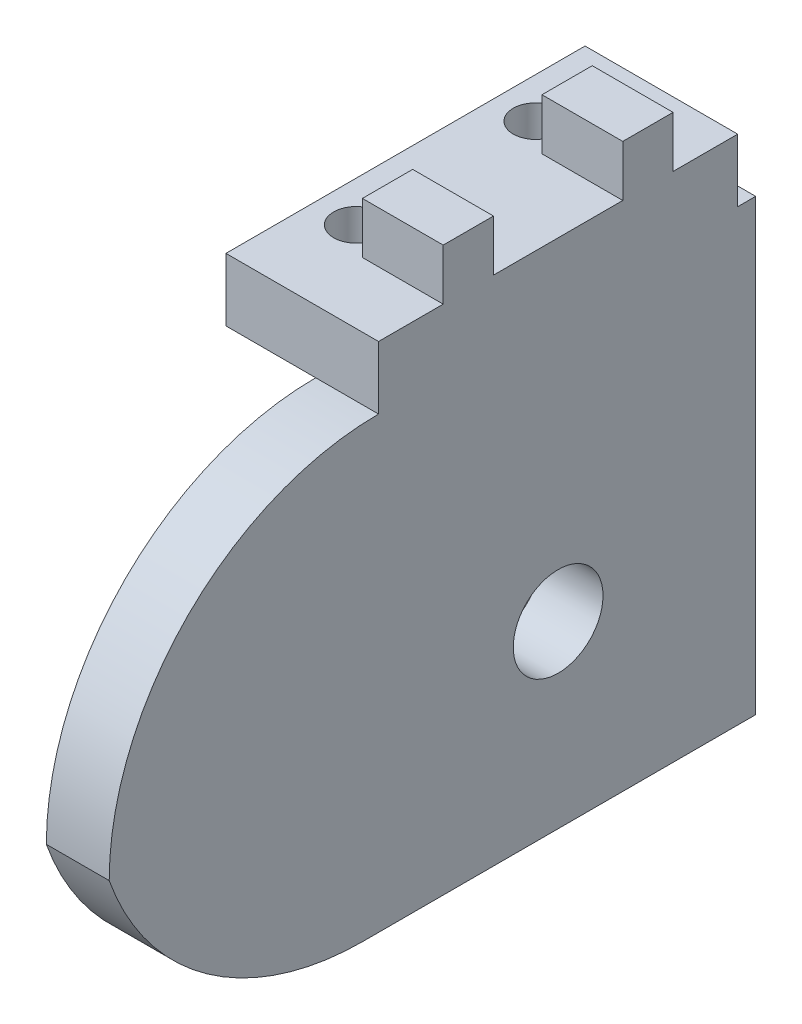
ISO-10303-21;
HEADER;
FILE_DESCRIPTION(('STEP AP214'),'2;1');
FILE_NAME('part.step','',(''),(''),'','','');
FILE_SCHEMA(('AUTOMOTIVE_DESIGN { 1 0 10303 214 1 1 1 1 }'));
ENDSEC;
DATA;
#1=APPLICATION_CONTEXT('core data for automotive mechanical design processes');
#2=APPLICATION_PROTOCOL_DEFINITION('international standard','automotive_design',2000,#1);
#3=PRODUCT_CONTEXT('',#1,'mechanical');
#4=PRODUCT('Part','Part','',(#3));
#5=PRODUCT_RELATED_PRODUCT_CATEGORY('part','',(#4));
#6=PRODUCT_DEFINITION_FORMATION('','',#4);
#7=PRODUCT_DEFINITION_CONTEXT('part definition',#1,'design');
#8=PRODUCT_DEFINITION('design','',#6,#7);
#9=PRODUCT_DEFINITION_SHAPE('','',#8);
#10=(LENGTH_UNIT() NAMED_UNIT(*) SI_UNIT(.MILLI.,.METRE.));
#11=(NAMED_UNIT(*) PLANE_ANGLE_UNIT() SI_UNIT($,.RADIAN.));
#12=(NAMED_UNIT(*) SI_UNIT($,.STERADIAN.) SOLID_ANGLE_UNIT());
#13=UNCERTAINTY_MEASURE_WITH_UNIT(LENGTH_MEASURE(1.E-05),#10,'distance_accuracy_value','');
#14=(GEOMETRIC_REPRESENTATION_CONTEXT(3) GLOBAL_UNCERTAINTY_ASSIGNED_CONTEXT((#13)) GLOBAL_UNIT_ASSIGNED_CONTEXT((#10,
#11,#12)) REPRESENTATION_CONTEXT('',''));
#15=CARTESIAN_POINT('',(0.,0.,0.));
#16=DIRECTION('',(0.,0.,1.));
#17=DIRECTION('',(1.,0.,0.));
#18=AXIS2_PLACEMENT_3D('',#15,#16,#17);
#19=CARTESIAN_POINT('',(0.,0.,0.));
#20=DIRECTION('',(0.,-1.,0.));
#21=DIRECTION('',(0.,0.,-1.));
#22=AXIS2_PLACEMENT_3D('',#19,#20,#21);
#23=PLANE('',#22);
#24=DIRECTION('',(0.,0.,-1.));
#25=VECTOR('',#24,1.);
#26=CARTESIAN_POINT('',(-10.,0.,50.));
#27=LINE('',#26,#25);
#28=CARTESIAN_POINT('',(-10.,0.,20.));
#29=VERTEX_POINT('',#28);
#30=CARTESIAN_POINT('',(-10.,0.,-20.));
#31=VERTEX_POINT('',#30);
#32=EDGE_CURVE('E190',#29,#31,#27,.T.);
#33=ORIENTED_EDGE('',*,*,#32,.F.);
#34=DIRECTION('',(1.,0.,0.));
#35=VECTOR('',#34,1.);
#36=CARTESIAN_POINT('',(20.,0.,20.));
#37=LINE('',#36,#35);
#38=CARTESIAN_POINT('',(-20.,0.,20.));
#39=VERTEX_POINT('',#38);
#40=EDGE_CURVE('E166',#39,#29,#37,.T.);
#41=ORIENTED_EDGE('',*,*,#40,.F.);
#42=DIRECTION('',(0.,0.,1.));
#43=VECTOR('',#42,1.);
#44=CARTESIAN_POINT('',(-20.,0.,-20.));
#45=LINE('',#44,#43);
#46=CARTESIAN_POINT('',(-20.,0.,-20.));
#47=VERTEX_POINT('',#46);
#48=EDGE_CURVE('E169',#47,#39,#45,.T.);
#49=ORIENTED_EDGE('',*,*,#48,.F.);
#50=DIRECTION('',(-1.,0.,0.));
#51=VECTOR('',#50,1.);
#52=CARTESIAN_POINT('',(20.,0.,-20.));
#53=LINE('',#52,#51);
#54=EDGE_CURVE('E203',#31,#47,#53,.T.);
#55=ORIENTED_EDGE('',*,*,#54,.F.);
#56=EDGE_LOOP('',(#33,#41,#49,#55));
#57=FACE_BOUND('',#56,.T.);
#58=CARTESIAN_POINT('',(-15.5,0.,-10.));
#59=DIRECTION('',(0.,-1.,0.));
#60=DIRECTION('',(0.,0.,-1.));
#61=AXIS2_PLACEMENT_3D('',#58,#59,#60);
#62=CIRCLE('',#61,2.5);
#63=CARTESIAN_POINT('',(-15.5,0.,-12.5));
#64=VERTEX_POINT('',#63);
#65=EDGE_CURVE('E246',#64,#64,#62,.F.);
#66=ORIENTED_EDGE('',*,*,#65,.T.);
#67=EDGE_LOOP('',(#66));
#68=FACE_BOUND('',#67,.T.);
#69=CARTESIAN_POINT('',(-15.5,0.,10.));
#70=DIRECTION('',(0.,-1.,0.));
#71=DIRECTION('',(0.,0.,-1.));
#72=AXIS2_PLACEMENT_3D('',#69,#70,#71);
#73=CIRCLE('',#72,2.5);
#74=CARTESIAN_POINT('',(-15.5,0.,7.50000000000001));
#75=VERTEX_POINT('',#74);
#76=EDGE_CURVE('E252',#75,#75,#73,.F.);
#77=ORIENTED_EDGE('',*,*,#76,.T.);
#78=EDGE_LOOP('',(#77));
#79=FACE_BOUND('',#78,.T.);
#80=ADVANCED_FACE('F32',(#57,#68,#79),#23,.T.);
#81=CARTESIAN_POINT('',(-20.,7.,-20.));
#82=DIRECTION('',(1.,0.,0.));
#83=DIRECTION('',(0.,0.,-1.));
#84=AXIS2_PLACEMENT_3D('',#81,#82,#83);
#85=PLANE('',#84);
#86=DIRECTION('',(0.,-1.,0.));
#87=VECTOR('',#86,1.);
#88=CARTESIAN_POINT('',(-20.,7.,20.));
#89=LINE('',#88,#87);
#90=CARTESIAN_POINT('',(-20.,7.,20.));
#91=VERTEX_POINT('',#90);
#92=EDGE_CURVE('E197',#91,#39,#89,.T.);
#93=ORIENTED_EDGE('',*,*,#92,.F.);
#94=DIRECTION('',(0.,0.,1.));
#95=VECTOR('',#94,1.);
#96=CARTESIAN_POINT('',(-20.,7.,-20.));
#97=LINE('',#96,#95);
#98=CARTESIAN_POINT('',(-20.,7.,-20.));
#99=VERTEX_POINT('',#98);
#100=EDGE_CURVE('E212',#99,#91,#97,.T.);
#101=ORIENTED_EDGE('',*,*,#100,.F.);
#102=DIRECTION('',(0.,-1.,0.));
#103=VECTOR('',#102,1.);
#104=CARTESIAN_POINT('',(-20.,7.,-20.));
#105=LINE('',#104,#103);
#106=EDGE_CURVE('E199',#99,#47,#105,.T.);
#107=ORIENTED_EDGE('',*,*,#106,.T.);
#108=ORIENTED_EDGE('',*,*,#48,.T.);
#109=EDGE_LOOP('',(#93,#101,#107,#108));
#110=FACE_BOUND('',#109,.T.);
#111=ADVANCED_FACE('F321',(#110),#85,.F.);
#112=CARTESIAN_POINT('',(20.,7.,20.));
#113=DIRECTION('',(0.,0.,-1.));
#114=DIRECTION('',(-1.,0.,0.));
#115=AXIS2_PLACEMENT_3D('',#112,#113,#114);
#116=PLANE('',#115);
#117=CARTESIAN_POINT('',(-3.00000000000001,0.,20.));
#118=VERTEX_POINT('',#117);
#119=EDGE_CURVE('E163',#29,#118,#37,.T.);
#120=ORIENTED_EDGE('',*,*,#119,.T.);
#121=DIRECTION('',(0.,1.,0.));
#122=VECTOR('',#121,1.);
#123=CARTESIAN_POINT('',(-3.00000000000001,7.,20.));
#124=LINE('',#123,#122);
#125=CARTESIAN_POINT('',(-3.00000000000001,7.,20.));
#126=VERTEX_POINT('',#125);
#127=EDGE_CURVE('E147',#118,#126,#124,.T.);
#128=ORIENTED_EDGE('',*,*,#127,.T.);
#129=DIRECTION('',(1.,0.,0.));
#130=VECTOR('',#129,1.);
#131=CARTESIAN_POINT('',(20.,7.,20.));
#132=LINE('',#131,#130);
#133=EDGE_CURVE('E210',#91,#126,#132,.T.);
#134=ORIENTED_EDGE('',*,*,#133,.F.);
#135=ORIENTED_EDGE('',*,*,#92,.T.);
#136=ORIENTED_EDGE('',*,*,#40,.T.);
#137=EDGE_LOOP('',(#120,#128,#134,#135,#136));
#138=FACE_BOUND('',#137,.T.);
#139=ADVANCED_FACE('F164',(#138),#116,.F.);
#140=CARTESIAN_POINT('',(20.,7.,-20.));
#141=DIRECTION('',(0.,0.,1.));
#142=DIRECTION('',(1.,0.,0.));
#143=AXIS2_PLACEMENT_3D('',#140,#141,#142);
#144=PLANE('',#143);
#145=DIRECTION('',(-1.,0.,0.));
#146=VECTOR('',#145,1.);
#147=CARTESIAN_POINT('',(20.,7.,-20.));
#148=LINE('',#147,#146);
#149=CARTESIAN_POINT('',(-3.00000000000001,7.,-20.));
#150=VERTEX_POINT('',#149);
#151=EDGE_CURVE('E202',#150,#99,#148,.T.);
#152=ORIENTED_EDGE('',*,*,#151,.F.);
#153=DIRECTION('',(0.,-1.,0.));
#154=VECTOR('',#153,1.);
#155=CARTESIAN_POINT('',(-3.00000000000001,7.,-20.));
#156=LINE('',#155,#154);
#157=CARTESIAN_POINT('',(-3.,0.,-20.));
#158=VERTEX_POINT('',#157);
#159=EDGE_CURVE('E159',#150,#158,#156,.T.);
#160=ORIENTED_EDGE('',*,*,#159,.T.);
#161=EDGE_CURVE('E204',#158,#31,#53,.T.);
#162=ORIENTED_EDGE('',*,*,#161,.T.);
#163=ORIENTED_EDGE('',*,*,#54,.T.);
#164=ORIENTED_EDGE('',*,*,#106,.F.);
#165=EDGE_LOOP('',(#152,#160,#162,#163,#164));
#166=FACE_BOUND('',#165,.T.);
#167=ADVANCED_FACE('F304',(#166),#144,.F.);
#168=CARTESIAN_POINT('',(0.,7.,0.));
#169=DIRECTION('',(0.,-1.,0.));
#170=DIRECTION('',(0.,0.,-1.));
#171=AXIS2_PLACEMENT_3D('',#168,#169,#170);
#172=PLANE('',#171);
#173=CARTESIAN_POINT('',(-15.5,7.,10.));
#174=DIRECTION('',(0.,1.,0.));
#175=DIRECTION('',(0.,0.,1.));
#176=AXIS2_PLACEMENT_3D('',#173,#174,#175);
#177=CIRCLE('',#176,2.5);
#178=CARTESIAN_POINT('',(-15.5,7.,12.5));
#179=VERTEX_POINT('',#178);
#180=EDGE_CURVE('E255',#179,#179,#177,.T.);
#181=ORIENTED_EDGE('',*,*,#180,.F.);
#182=EDGE_LOOP('',(#181));
#183=FACE_BOUND('',#182,.T.);
#184=CARTESIAN_POINT('',(-15.5,7.,-10.));
#185=DIRECTION('',(0.,1.,0.));
#186=DIRECTION('',(0.,0.,1.));
#187=AXIS2_PLACEMENT_3D('',#184,#185,#186);
#188=CIRCLE('',#187,2.5);
#189=CARTESIAN_POINT('',(-15.5,7.,-7.5));
#190=VERTEX_POINT('',#189);
#191=EDGE_CURVE('E249',#190,#190,#188,.T.);
#192=ORIENTED_EDGE('',*,*,#191,.F.);
#193=EDGE_LOOP('',(#192));
#194=FACE_BOUND('',#193,.T.);
#195=ORIENTED_EDGE('',*,*,#133,.T.);
#196=DIRECTION('',(0.,0.,-1.));
#197=VECTOR('',#196,1.);
#198=CARTESIAN_POINT('',(-3.00000000000001,7.,0.));
#199=LINE('',#198,#197);
#200=CARTESIAN_POINT('',(-3.00000000000001,7.,12.8));
#201=VERTEX_POINT('',#200);
#202=EDGE_CURVE('E154',#126,#201,#199,.T.);
#203=ORIENTED_EDGE('',*,*,#202,.T.);
#204=DIRECTION('',(-1.,0.,0.));
#205=VECTOR('',#204,1.);
#206=CARTESIAN_POINT('',(27.9906195003892,7.,12.8));
#207=LINE('',#206,#205);
#208=CARTESIAN_POINT('',(-12.,7.,12.8));
#209=VERTEX_POINT('',#208);
#210=EDGE_CURVE('E224',#201,#209,#207,.T.);
#211=ORIENTED_EDGE('',*,*,#210,.T.);
#212=DIRECTION('',(0.,0.,-1.));
#213=VECTOR('',#212,1.);
#214=CARTESIAN_POINT('',(-12.,7.,-20.));
#215=LINE('',#214,#213);
#216=CARTESIAN_POINT('',(-12.,7.,7.2));
#217=VERTEX_POINT('',#216);
#218=EDGE_CURVE('E238',#209,#217,#215,.T.);
#219=ORIENTED_EDGE('',*,*,#218,.T.);
#220=DIRECTION('',(-1.,0.,0.));
#221=VECTOR('',#220,1.);
#222=CARTESIAN_POINT('',(27.9906195003892,7.,7.19999999999999));
#223=LINE('',#222,#221);
#224=CARTESIAN_POINT('',(-3.00000000000001,7.,7.2));
#225=VERTEX_POINT('',#224);
#226=EDGE_CURVE('E222',#225,#217,#223,.T.);
#227=ORIENTED_EDGE('',*,*,#226,.F.);
#228=CARTESIAN_POINT('',(-3.00000000000001,7.,-7.20000000000001));
#229=VERTEX_POINT('',#228);
#230=EDGE_CURVE('E290',#225,#229,#199,.T.);
#231=ORIENTED_EDGE('',*,*,#230,.T.);
#232=DIRECTION('',(-1.,0.,0.));
#233=VECTOR('',#232,1.);
#234=CARTESIAN_POINT('',(27.9906195003892,7.,-7.20000000000001));
#235=LINE('',#234,#233);
#236=CARTESIAN_POINT('',(-12.,7.,-7.2));
#237=VERTEX_POINT('',#236);
#238=EDGE_CURVE('E208',#229,#237,#235,.T.);
#239=ORIENTED_EDGE('',*,*,#238,.T.);
#240=CARTESIAN_POINT('',(-12.,7.,-12.8));
#241=VERTEX_POINT('',#240);
#242=EDGE_CURVE('E239',#237,#241,#215,.T.);
#243=ORIENTED_EDGE('',*,*,#242,.T.);
#244=DIRECTION('',(-1.,0.,0.));
#245=VECTOR('',#244,1.);
#246=CARTESIAN_POINT('',(27.9906195003892,7.,-12.8));
#247=LINE('',#246,#245);
#248=CARTESIAN_POINT('',(-3.,7.,-12.8));
#249=VERTEX_POINT('',#248);
#250=EDGE_CURVE('E219',#249,#241,#247,.T.);
#251=ORIENTED_EDGE('',*,*,#250,.F.);
#252=EDGE_CURVE('E158',#249,#150,#199,.T.);
#253=ORIENTED_EDGE('',*,*,#252,.T.);
#254=ORIENTED_EDGE('',*,*,#151,.T.);
#255=ORIENTED_EDGE('',*,*,#100,.T.);
#256=EDGE_LOOP('',(#195,#203,#211,#219,#227,#231,#239,#243,#251,#253,#254,#255));
#257=FACE_BOUND('',#256,.T.);
#258=ADVANCED_FACE('F323',(#183,#194,#257),#172,.F.);
#259=CARTESIAN_POINT('',(27.9906195003892,7.,-7.20000000000001));
#260=DIRECTION('',(0.,0.,1.));
#261=DIRECTION('',(1.,0.,0.));
#262=AXIS2_PLACEMENT_3D('',#259,#260,#261);
#263=PLANE('',#262);
#264=DIRECTION('',(0.,-1.,0.));
#265=VECTOR('',#264,1.);
#266=CARTESIAN_POINT('',(-3.00000000000001,7.,-7.20000000000001));
#267=LINE('',#266,#265);
#268=CARTESIAN_POINT('',(-3.00000000000001,12.7,-7.2));
#269=VERTEX_POINT('',#268);
#270=EDGE_CURVE('E284',#269,#229,#267,.T.);
#271=ORIENTED_EDGE('',*,*,#270,.F.);
#272=DIRECTION('',(-1.,0.,0.));
#273=VECTOR('',#272,1.);
#274=CARTESIAN_POINT('',(27.9906195003892,12.7,-7.20000000000001));
#275=LINE('',#274,#273);
#276=CARTESIAN_POINT('',(-12.,12.7,-7.2));
#277=VERTEX_POINT('',#276);
#278=EDGE_CURVE('E214',#269,#277,#275,.T.);
#279=ORIENTED_EDGE('',*,*,#278,.T.);
#280=DIRECTION('',(0.,1.,0.));
#281=VECTOR('',#280,1.);
#282=CARTESIAN_POINT('',(-12.,7.,-7.2));
#283=LINE('',#282,#281);
#284=EDGE_CURVE('E225',#237,#277,#283,.T.);
#285=ORIENTED_EDGE('',*,*,#284,.F.);
#286=ORIENTED_EDGE('',*,*,#238,.F.);
#287=EDGE_LOOP('',(#271,#279,#285,#286));
#288=FACE_BOUND('',#287,.T.);
#289=ADVANCED_FACE('F342',(#288),#263,.T.);
#290=CARTESIAN_POINT('',(27.9906195003892,7.,-12.8));
#291=DIRECTION('',(0.,0.,-1.));
#292=DIRECTION('',(0.,1.,0.));
#293=AXIS2_PLACEMENT_3D('',#290,#291,#292);
#294=PLANE('',#293);
#295=DIRECTION('',(0.,1.,0.));
#296=VECTOR('',#295,1.);
#297=CARTESIAN_POINT('',(-3.00000000000001,7.,-12.8));
#298=LINE('',#297,#296);
#299=CARTESIAN_POINT('',(-3.00000000000001,12.7,-12.8));
#300=VERTEX_POINT('',#299);
#301=EDGE_CURVE('E291',#249,#300,#298,.T.);
#302=ORIENTED_EDGE('',*,*,#301,.F.);
#303=ORIENTED_EDGE('',*,*,#250,.T.);
#304=DIRECTION('',(0.,-1.,0.));
#305=VECTOR('',#304,1.);
#306=CARTESIAN_POINT('',(-12.,7.,-12.8));
#307=LINE('',#306,#305);
#308=CARTESIAN_POINT('',(-12.,12.7,-12.8));
#309=VERTEX_POINT('',#308);
#310=EDGE_CURVE('E232',#309,#241,#307,.T.);
#311=ORIENTED_EDGE('',*,*,#310,.F.);
#312=DIRECTION('',(-1.,0.,0.));
#313=VECTOR('',#312,1.);
#314=CARTESIAN_POINT('',(27.9906195003892,12.7,-12.8));
#315=LINE('',#314,#313);
#316=EDGE_CURVE('E216',#300,#309,#315,.T.);
#317=ORIENTED_EDGE('',*,*,#316,.F.);
#318=EDGE_LOOP('',(#302,#303,#311,#317));
#319=FACE_BOUND('',#318,.T.);
#320=ADVANCED_FACE('F329',(#319),#294,.T.);
#321=CARTESIAN_POINT('',(27.9906195003892,12.7,-7.20000000000001));
#322=DIRECTION('',(0.,1.,0.));
#323=DIRECTION('',(0.,0.,1.));
#324=AXIS2_PLACEMENT_3D('',#321,#322,#323);
#325=PLANE('',#324);
#326=DIRECTION('',(0.,0.,1.));
#327=VECTOR('',#326,1.);
#328=CARTESIAN_POINT('',(-3.00000000000001,12.7,-7.20000000000001));
#329=LINE('',#328,#327);
#330=EDGE_CURVE('E288',#300,#269,#329,.T.);
#331=ORIENTED_EDGE('',*,*,#330,.F.);
#332=ORIENTED_EDGE('',*,*,#316,.T.);
#333=DIRECTION('',(0.,0.,-1.));
#334=VECTOR('',#333,1.);
#335=CARTESIAN_POINT('',(-12.,12.7,-20.));
#336=LINE('',#335,#334);
#337=EDGE_CURVE('E243',#277,#309,#336,.T.);
#338=ORIENTED_EDGE('',*,*,#337,.F.);
#339=ORIENTED_EDGE('',*,*,#278,.F.);
#340=EDGE_LOOP('',(#331,#332,#338,#339));
#341=FACE_BOUND('',#340,.T.);
#342=ADVANCED_FACE('F333',(#341),#325,.T.);
#343=CARTESIAN_POINT('',(27.9906195003892,7.,7.19999999999999));
#344=DIRECTION('',(0.,0.,-1.));
#345=DIRECTION('',(-1.,0.,0.));
#346=AXIS2_PLACEMENT_3D('',#343,#344,#345);
#347=PLANE('',#346);
#348=DIRECTION('',(0.,1.,0.));
#349=VECTOR('',#348,1.);
#350=CARTESIAN_POINT('',(-3.00000000000001,7.,7.2));
#351=LINE('',#350,#349);
#352=CARTESIAN_POINT('',(-3.00000000000001,12.7,7.19999999999999));
#353=VERTEX_POINT('',#352);
#354=EDGE_CURVE('E293',#225,#353,#351,.T.);
#355=ORIENTED_EDGE('',*,*,#354,.F.);
#356=ORIENTED_EDGE('',*,*,#226,.T.);
#357=DIRECTION('',(0.,-1.,0.));
#358=VECTOR('',#357,1.);
#359=CARTESIAN_POINT('',(-12.,7.,7.2));
#360=LINE('',#359,#358);
#361=CARTESIAN_POINT('',(-12.,12.7,7.19999999999999));
#362=VERTEX_POINT('',#361);
#363=EDGE_CURVE('E235',#362,#217,#360,.T.);
#364=ORIENTED_EDGE('',*,*,#363,.F.);
#365=DIRECTION('',(-1.,0.,0.));
#366=VECTOR('',#365,1.);
#367=CARTESIAN_POINT('',(27.9906195003892,12.7,7.19999999999999));
#368=LINE('',#367,#366);
#369=EDGE_CURVE('E217',#353,#362,#368,.T.);
#370=ORIENTED_EDGE('',*,*,#369,.F.);
#371=EDGE_LOOP('',(#355,#356,#364,#370));
#372=FACE_BOUND('',#371,.T.);
#373=ADVANCED_FACE('F362',(#372),#347,.T.);
#374=CARTESIAN_POINT('',(27.9906195003892,12.7,7.19999999999999));
#375=DIRECTION('',(0.,1.,0.));
#376=DIRECTION('',(0.,0.,1.));
#377=AXIS2_PLACEMENT_3D('',#374,#375,#376);
#378=PLANE('',#377);
#379=DIRECTION('',(0.,0.,1.));
#380=VECTOR('',#379,1.);
#381=CARTESIAN_POINT('',(-3.00000000000001,12.7,7.19999999999999));
#382=LINE('',#381,#380);
#383=CARTESIAN_POINT('',(-3.00000000000001,12.7,12.8));
#384=VERTEX_POINT('',#383);
#385=EDGE_CURVE('E47',#353,#384,#382,.T.);
#386=ORIENTED_EDGE('',*,*,#385,.F.);
#387=ORIENTED_EDGE('',*,*,#369,.T.);
#388=CARTESIAN_POINT('',(-12.,12.7,12.8));
#389=VERTEX_POINT('',#388);
#390=EDGE_CURVE('E242',#389,#362,#336,.T.);
#391=ORIENTED_EDGE('',*,*,#390,.F.);
#392=DIRECTION('',(-1.,0.,0.));
#393=VECTOR('',#392,1.);
#394=CARTESIAN_POINT('',(27.9906195003892,12.7,12.8));
#395=LINE('',#394,#393);
#396=EDGE_CURVE('E227',#384,#389,#395,.T.);
#397=ORIENTED_EDGE('',*,*,#396,.F.);
#398=EDGE_LOOP('',(#386,#387,#391,#397));
#399=FACE_BOUND('',#398,.T.);
#400=ADVANCED_FACE('F359',(#399),#378,.T.);
#401=CARTESIAN_POINT('',(27.9906195003892,7.,12.8));
#402=DIRECTION('',(0.,0.,1.));
#403=DIRECTION('',(1.,0.,0.));
#404=AXIS2_PLACEMENT_3D('',#401,#402,#403);
#405=PLANE('',#404);
#406=DIRECTION('',(0.,-1.,0.));
#407=VECTOR('',#406,1.);
#408=CARTESIAN_POINT('',(-3.00000000000001,7.,12.8));
#409=LINE('',#408,#407);
#410=EDGE_CURVE('E296',#384,#201,#409,.T.);
#411=ORIENTED_EDGE('',*,*,#410,.F.);
#412=ORIENTED_EDGE('',*,*,#396,.T.);
#413=DIRECTION('',(0.,1.,0.));
#414=VECTOR('',#413,1.);
#415=CARTESIAN_POINT('',(-12.,7.,12.8));
#416=LINE('',#415,#414);
#417=EDGE_CURVE('E191',#209,#389,#416,.T.);
#418=ORIENTED_EDGE('',*,*,#417,.F.);
#419=ORIENTED_EDGE('',*,*,#210,.F.);
#420=EDGE_LOOP('',(#411,#412,#418,#419));
#421=FACE_BOUND('',#420,.T.);
#422=ADVANCED_FACE('F351',(#421),#405,.T.);
#423=CARTESIAN_POINT('',(-12.,-33.7921561087423,-20.));
#424=DIRECTION('',(1.,0.,0.));
#425=DIRECTION('',(0.,0.,-1.));
#426=AXIS2_PLACEMENT_3D('',#423,#424,#425);
#427=PLANE('',#426);
#428=ORIENTED_EDGE('',*,*,#363,.T.);
#429=ORIENTED_EDGE('',*,*,#218,.F.);
#430=ORIENTED_EDGE('',*,*,#417,.T.);
#431=ORIENTED_EDGE('',*,*,#390,.T.);
#432=EDGE_LOOP('',(#428,#429,#430,#431));
#433=FACE_BOUND('',#432,.T.);
#434=ADVANCED_FACE('F356',(#433),#427,.F.);
#435=ORIENTED_EDGE('',*,*,#284,.T.);
#436=ORIENTED_EDGE('',*,*,#337,.T.);
#437=ORIENTED_EDGE('',*,*,#310,.T.);
#438=ORIENTED_EDGE('',*,*,#242,.F.);
#439=EDGE_LOOP('',(#435,#436,#437,#438));
#440=FACE_BOUND('',#439,.T.);
#441=ADVANCED_FACE('F336',(#440),#427,.F.);
#442=CARTESIAN_POINT('',(-15.5,-7.07106781186548,-10.));
#443=DIRECTION('',(0.,1.,0.));
#444=DIRECTION('',(0.,0.,1.));
#445=AXIS2_PLACEMENT_3D('',#442,#443,#444);
#446=CYLINDRICAL_SURFACE('',#445,2.5);
#447=ORIENTED_EDGE('',*,*,#191,.T.);
#448=EDGE_LOOP('',(#447));
#449=FACE_BOUND('',#448,.T.);
#450=ORIENTED_EDGE('',*,*,#65,.F.);
#451=EDGE_LOOP('',(#450));
#452=FACE_BOUND('',#451,.T.);
#453=ADVANCED_FACE('F417',(#449,#452),#446,.F.);
#454=CARTESIAN_POINT('',(-15.5,-7.07106781186548,10.));
#455=DIRECTION('',(0.,1.,0.));
#456=DIRECTION('',(0.,0.,1.));
#457=AXIS2_PLACEMENT_3D('',#454,#455,#456);
#458=CYLINDRICAL_SURFACE('',#457,2.5);
#459=ORIENTED_EDGE('',*,*,#180,.T.);
#460=EDGE_LOOP('',(#459));
#461=FACE_BOUND('',#460,.T.);
#462=ORIENTED_EDGE('',*,*,#76,.F.);
#463=EDGE_LOOP('',(#462));
#464=FACE_BOUND('',#463,.T.);
#465=ADVANCED_FACE('F406',(#461,#464),#458,.F.);
#466=CARTESIAN_POINT('',(0.,0.,0.));
#467=DIRECTION('',(0.,1.,0.));
#468=DIRECTION('',(0.,0.,1.));
#469=AXIS2_PLACEMENT_3D('',#466,#467,#468);
#470=PLANE('',#469);
#471=ORIENTED_EDGE('',*,*,#161,.F.);
#472=DIRECTION('',(0.,0.,1.));
#473=VECTOR('',#472,1.);
#474=CARTESIAN_POINT('',(-3.00000000000001,0.,50.));
#475=LINE('',#474,#473);
#476=CARTESIAN_POINT('',(-3.,0.,-22.));
#477=VERTEX_POINT('',#476);
#478=EDGE_CURVE('E265',#477,#158,#475,.T.);
#479=ORIENTED_EDGE('',*,*,#478,.F.);
#480=DIRECTION('',(1.,0.,0.));
#481=VECTOR('',#480,1.);
#482=CARTESIAN_POINT('',(-3.,0.,-22.));
#483=LINE('',#482,#481);
#484=CARTESIAN_POINT('',(-10.,0.,-22.));
#485=VERTEX_POINT('',#484);
#486=EDGE_CURVE('E268',#485,#477,#483,.T.);
#487=ORIENTED_EDGE('',*,*,#486,.F.);
#488=EDGE_CURVE('E193',#31,#485,#27,.T.);
#489=ORIENTED_EDGE('',*,*,#488,.F.);
#490=EDGE_LOOP('',(#471,#479,#487,#489));
#491=FACE_BOUND('',#490,.T.);
#492=ADVANCED_FACE('F309',(#491),#470,.T.);
#493=CARTESIAN_POINT('',(-10.,-50.,50.));
#494=DIRECTION('',(1.,0.,0.));
#495=DIRECTION('',(0.,0.,-1.));
#496=AXIS2_PLACEMENT_3D('',#493,#494,#495);
#497=PLANE('',#496);
#498=CARTESIAN_POINT('',(-10.,-30.,30.));
#499=DIRECTION('',(-1.,0.,0.));
#500=DIRECTION('',(0.,0.,1.));
#501=AXIS2_PLACEMENT_3D('',#498,#499,#500);
#502=CIRCLE('',#501,4.25);
#503=CARTESIAN_POINT('',(-10.,-30.,34.25));
#504=VERTEX_POINT('',#503);
#505=EDGE_CURVE('E281',#504,#504,#502,.T.);
#506=ORIENTED_EDGE('',*,*,#505,.F.);
#507=EDGE_LOOP('',(#506));
#508=FACE_BOUND('',#507,.T.);
#509=CARTESIAN_POINT('',(-10.,-30.,0.));
#510=DIRECTION('',(1.,0.,0.));
#511=DIRECTION('',(0.,0.,-1.));
#512=AXIS2_PLACEMENT_3D('',#509,#510,#511);
#513=CIRCLE('',#512,5.);
#514=CARTESIAN_POINT('',(-10.,-30.,-5.));
#515=VERTEX_POINT('',#514);
#516=EDGE_CURVE('E270',#515,#515,#513,.F.);
#517=ORIENTED_EDGE('',*,*,#516,.F.);
#518=EDGE_LOOP('',(#517));
#519=FACE_BOUND('',#518,.T.);
#520=DIRECTION('',(0.,0.,-1.));
#521=VECTOR('',#520,1.);
#522=CARTESIAN_POINT('',(-10.,-50.,50.));
#523=LINE('',#522,#521);
#524=CARTESIAN_POINT('',(-10.,-50.,21.7157287525381));
#525=VERTEX_POINT('',#524);
#526=CARTESIAN_POINT('',(-10.,-50.,-22.));
#527=VERTEX_POINT('',#526);
#528=EDGE_CURVE('E187',#525,#527,#523,.T.);
#529=ORIENTED_EDGE('',*,*,#528,.F.);
#530=CARTESIAN_POINT('',(-10.,-20.,21.7157287525381));
#531=DIRECTION('',(1.,0.,0.));
#532=DIRECTION('',(0.,0.,-1.));
#533=AXIS2_PLACEMENT_3D('',#530,#531,#532);
#534=CIRCLE('',#533,30.);
#535=CARTESIAN_POINT('',(-10.,-30.,50.));
#536=VERTEX_POINT('',#535);
#537=EDGE_CURVE('E40',#525,#536,#534,.F.);
#538=ORIENTED_EDGE('',*,*,#537,.T.);
#539=CARTESIAN_POINT('',(-10.,-30.,20.));
#540=DIRECTION('',(1.,0.,0.));
#541=DIRECTION('',(0.,0.,-1.));
#542=AXIS2_PLACEMENT_3D('',#539,#540,#541);
#543=CIRCLE('',#542,30.);
#544=EDGE_CURVE('E175',#536,#29,#543,.F.);
#545=ORIENTED_EDGE('',*,*,#544,.T.);
#546=ORIENTED_EDGE('',*,*,#32,.T.);
#547=ORIENTED_EDGE('',*,*,#488,.T.);
#548=DIRECTION('',(0.,1.,0.));
#549=VECTOR('',#548,1.);
#550=CARTESIAN_POINT('',(-10.,-50.,-22.));
#551=LINE('',#550,#549);
#552=EDGE_CURVE('E258',#527,#485,#551,.T.);
#553=ORIENTED_EDGE('',*,*,#552,.F.);
#554=EDGE_LOOP('',(#529,#538,#545,#546,#547,#553));
#555=FACE_BOUND('',#554,.T.);
#556=ADVANCED_FACE('F183',(#508,#519,#555),#497,.F.);
#557=CARTESIAN_POINT('',(-3.,-50.,-22.));
#558=DIRECTION('',(0.,0.,1.));
#559=DIRECTION('',(1.,0.,0.));
#560=AXIS2_PLACEMENT_3D('',#557,#558,#559);
#561=PLANE('',#560);
#562=ORIENTED_EDGE('',*,*,#486,.T.);
#563=DIRECTION('',(0.,1.,0.));
#564=VECTOR('',#563,1.);
#565=CARTESIAN_POINT('',(-3.,-50.,-22.));
#566=LINE('',#565,#564);
#567=CARTESIAN_POINT('',(-3.,-50.,-22.));
#568=VERTEX_POINT('',#567);
#569=EDGE_CURVE('E261',#568,#477,#566,.T.);
#570=ORIENTED_EDGE('',*,*,#569,.F.);
#571=DIRECTION('',(1.,0.,0.));
#572=VECTOR('',#571,1.);
#573=CARTESIAN_POINT('',(-3.,-50.,-22.));
#574=LINE('',#573,#572);
#575=EDGE_CURVE('E272',#527,#568,#574,.T.);
#576=ORIENTED_EDGE('',*,*,#575,.F.);
#577=ORIENTED_EDGE('',*,*,#552,.T.);
#578=EDGE_LOOP('',(#562,#570,#576,#577));
#579=FACE_BOUND('',#578,.T.);
#580=ADVANCED_FACE('F314',(#579),#561,.F.);
#581=CARTESIAN_POINT('',(-3.00000000000001,-50.,50.));
#582=DIRECTION('',(-1.,0.,0.));
#583=DIRECTION('',(0.,0.,1.));
#584=AXIS2_PLACEMENT_3D('',#581,#582,#583);
#585=PLANE('',#584);
#586=CARTESIAN_POINT('',(-3.00000000000001,-30.,0.));
#587=DIRECTION('',(1.,0.,0.));
#588=DIRECTION('',(0.,0.,-1.));
#589=AXIS2_PLACEMENT_3D('',#586,#587,#588);
#590=CIRCLE('',#589,5.);
#591=CARTESIAN_POINT('',(-3.00000000000001,-30.,-5.));
#592=VERTEX_POINT('',#591);
#593=EDGE_CURVE('E277',#592,#592,#590,.T.);
#594=ORIENTED_EDGE('',*,*,#593,.F.);
#595=EDGE_LOOP('',(#594));
#596=FACE_BOUND('',#595,.T.);
#597=CARTESIAN_POINT('',(-3.00000000000001,-30.,20.));
#598=DIRECTION('',(-1.,0.,0.));
#599=DIRECTION('',(0.,0.,1.));
#600=AXIS2_PLACEMENT_3D('',#597,#598,#599);
#601=CIRCLE('',#600,30.);
#602=CARTESIAN_POINT('',(-3.00000000000001,-30.,50.));
#603=VERTEX_POINT('',#602);
#604=EDGE_CURVE('E151',#118,#603,#601,.F.);
#605=ORIENTED_EDGE('',*,*,#604,.T.);
#606=CARTESIAN_POINT('',(-3.00000000000001,-20.,21.7157287525381));
#607=DIRECTION('',(-1.,0.,0.));
#608=DIRECTION('',(0.,0.,1.));
#609=AXIS2_PLACEMENT_3D('',#606,#607,#608);
#610=CIRCLE('',#609,30.);
#611=CARTESIAN_POINT('',(-3.00000000000001,-50.,21.7157287525381));
#612=VERTEX_POINT('',#611);
#613=EDGE_CURVE('E11',#603,#612,#610,.F.);
#614=ORIENTED_EDGE('',*,*,#613,.T.);
#615=DIRECTION('',(0.,0.,1.));
#616=VECTOR('',#615,1.);
#617=CARTESIAN_POINT('',(-3.00000000000001,-50.,50.));
#618=LINE('',#617,#616);
#619=EDGE_CURVE('E264',#568,#612,#618,.T.);
#620=ORIENTED_EDGE('',*,*,#619,.F.);
#621=ORIENTED_EDGE('',*,*,#569,.T.);
#622=ORIENTED_EDGE('',*,*,#478,.T.);
#623=ORIENTED_EDGE('',*,*,#159,.F.);
#624=ORIENTED_EDGE('',*,*,#252,.F.);
#625=ORIENTED_EDGE('',*,*,#301,.T.);
#626=ORIENTED_EDGE('',*,*,#330,.T.);
#627=ORIENTED_EDGE('',*,*,#270,.T.);
#628=ORIENTED_EDGE('',*,*,#230,.F.);
#629=ORIENTED_EDGE('',*,*,#354,.T.);
#630=ORIENTED_EDGE('',*,*,#385,.T.);
#631=ORIENTED_EDGE('',*,*,#410,.T.);
#632=ORIENTED_EDGE('',*,*,#202,.F.);
#633=ORIENTED_EDGE('',*,*,#127,.F.);
#634=EDGE_LOOP('',(#605,#614,#620,#621,#622,#623,#624,#625,#626,#627,#628,#629,#630,#631,#632,#633));
#635=FACE_BOUND('',#634,.T.);
#636=ADVANCED_FACE('F149',(#596,#635),#585,.F.);
#637=CARTESIAN_POINT('',(0.,-50.,0.));
#638=DIRECTION('',(0.,1.,0.));
#639=DIRECTION('',(0.,0.,1.));
#640=AXIS2_PLACEMENT_3D('',#637,#638,#639);
#641=PLANE('',#640);
#642=ORIENTED_EDGE('',*,*,#619,.T.);
#643=DIRECTION('',(-1.,0.,0.));
#644=VECTOR('',#643,1.);
#645=CARTESIAN_POINT('',(0.,-50.,21.7157287525381));
#646=LINE('',#645,#644);
#647=EDGE_CURVE('E174',#612,#525,#646,.T.);
#648=ORIENTED_EDGE('',*,*,#647,.T.);
#649=ORIENTED_EDGE('',*,*,#528,.T.);
#650=ORIENTED_EDGE('',*,*,#575,.T.);
#651=EDGE_LOOP('',(#642,#648,#649,#650));
#652=FACE_BOUND('',#651,.T.);
#653=ADVANCED_FACE('F392',(#652),#641,.F.);
#654=CARTESIAN_POINT('',(-24.142135623731,-30.,0.));
#655=DIRECTION('',(1.,0.,0.));
#656=DIRECTION('',(0.,0.,-1.));
#657=AXIS2_PLACEMENT_3D('',#654,#655,#656);
#658=CYLINDRICAL_SURFACE('',#657,5.);
#659=ORIENTED_EDGE('',*,*,#516,.T.);
#660=EDGE_LOOP('',(#659));
#661=FACE_BOUND('',#660,.T.);
#662=ORIENTED_EDGE('',*,*,#593,.T.);
#663=EDGE_LOOP('',(#662));
#664=FACE_BOUND('',#663,.T.);
#665=ADVANCED_FACE('F386',(#661,#664),#658,.F.);
#666=CARTESIAN_POINT('',(-3.00000000000001,-30.,20.));
#667=DIRECTION('',(1.,0.,0.));
#668=DIRECTION('',(0.,0.,-1.));
#669=AXIS2_PLACEMENT_3D('',#666,#667,#668);
#670=CYLINDRICAL_SURFACE('',#669,30.);
#671=ORIENTED_EDGE('',*,*,#604,.F.);
#672=ORIENTED_EDGE('',*,*,#119,.F.);
#673=ORIENTED_EDGE('',*,*,#544,.F.);
#674=DIRECTION('',(-1.,0.,0.));
#675=VECTOR('',#674,1.);
#676=CARTESIAN_POINT('',(-10.,-30.,50.));
#677=LINE('',#676,#675);
#678=EDGE_CURVE('E173',#603,#536,#677,.T.);
#679=ORIENTED_EDGE('',*,*,#678,.F.);
#680=EDGE_LOOP('',(#671,#672,#673,#679));
#681=FACE_BOUND('',#680,.T.);
#682=ADVANCED_FACE('F171',(#681),#670,.T.);
#683=CARTESIAN_POINT('',(-3.00000000000001,-20.,21.7157287525381));
#684=DIRECTION('',(-1.,0.,0.));
#685=DIRECTION('',(0.,0.,1.));
#686=AXIS2_PLACEMENT_3D('',#683,#684,#685);
#687=CYLINDRICAL_SURFACE('',#686,30.);
#688=ORIENTED_EDGE('',*,*,#613,.F.);
#689=ORIENTED_EDGE('',*,*,#678,.T.);
#690=ORIENTED_EDGE('',*,*,#537,.F.);
#691=ORIENTED_EDGE('',*,*,#647,.F.);
#692=EDGE_LOOP('',(#688,#689,#690,#691));
#693=FACE_BOUND('',#692,.T.);
#694=ADVANCED_FACE('F34',(#693),#687,.T.);
#695=CARTESIAN_POINT('',(-7.00000000000001,-30.,30.));
#696=DIRECTION('',(-1.,0.,0.));
#697=DIRECTION('',(0.,0.,1.));
#698=AXIS2_PLACEMENT_3D('',#695,#696,#697);
#699=CYLINDRICAL_SURFACE('',#698,4.25);
#700=CARTESIAN_POINT('',(-7.00000000000001,-30.,30.));
#701=DIRECTION('',(-1.,0.,0.));
#702=DIRECTION('',(0.,0.,1.));
#703=AXIS2_PLACEMENT_3D('',#700,#701,#702);
#704=CIRCLE('',#703,4.25);
#705=CARTESIAN_POINT('',(-7.00000000000001,-30.,34.25));
#706=VERTEX_POINT('',#705);
#707=EDGE_CURVE('E280',#706,#706,#704,.T.);
#708=ORIENTED_EDGE('',*,*,#707,.F.);
#709=EDGE_LOOP('',(#708));
#710=FACE_BOUND('',#709,.T.);
#711=ORIENTED_EDGE('',*,*,#505,.T.);
#712=EDGE_LOOP('',(#711));
#713=FACE_BOUND('',#712,.T.);
#714=ADVANCED_FACE('F391',(#710,#713),#699,.F.);
#715=CARTESIAN_POINT('',(-7.00000000000001,-30.,30.));
#716=DIRECTION('',(-1.,0.,0.));
#717=DIRECTION('',(0.,0.,1.));
#718=AXIS2_PLACEMENT_3D('',#715,#716,#717);
#719=PLANE('',#718);
#720=ORIENTED_EDGE('',*,*,#707,.T.);
#721=EDGE_LOOP('',(#720));
#722=FACE_BOUND('',#721,.T.);
#723=ADVANCED_FACE('F486',(#722),#719,.T.);
#724=CLOSED_SHELL('',(#80,#111,#139,#167,#258,#289,#320,#342,#373,#400,#422,#434,#441,#453,#465,
#492,#556,#580,#636,#653,#665,#682,#694,#714,#723));
#725=MANIFOLD_SOLID_BREP('B2',#724);
#726=ADVANCED_BREP_SHAPE_REPRESENTATION('',(#18,#725),#14);
#727=SHAPE_DEFINITION_REPRESENTATION(#9,#726);
ENDSEC;
END-ISO-10303-21;
